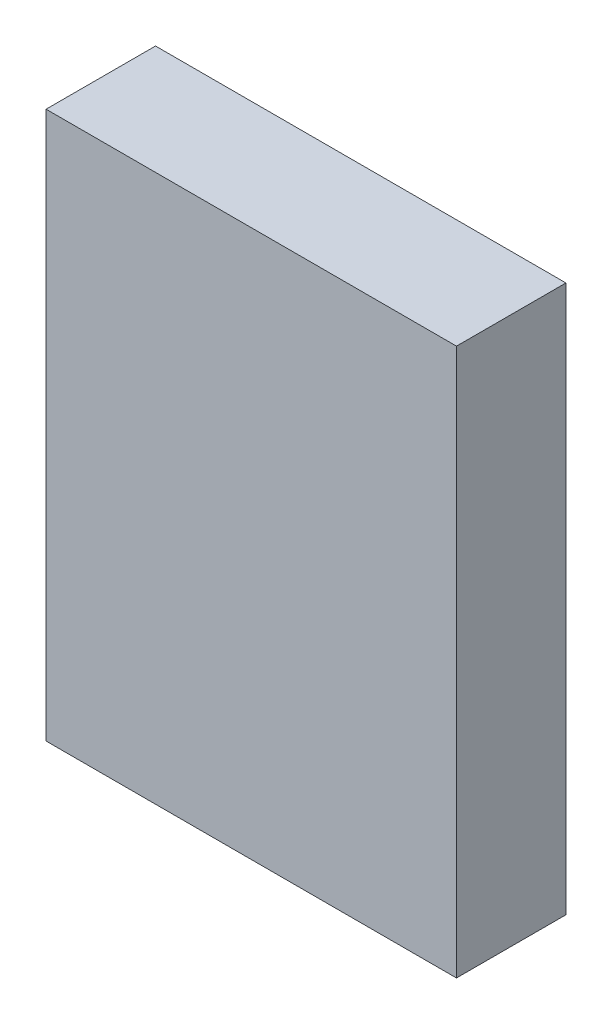
ISO-10303-21;
HEADER;
FILE_DESCRIPTION(('STEP AP214'),'2;1');
FILE_NAME('part.step','',(''),(''),'','','');
FILE_SCHEMA(('AUTOMOTIVE_DESIGN { 1 0 10303 214 1 1 1 1 }'));
ENDSEC;
DATA;
#1=APPLICATION_CONTEXT('core data for automotive mechanical design processes');
#2=APPLICATION_PROTOCOL_DEFINITION('international standard','automotive_design',2000,#1);
#3=PRODUCT_CONTEXT('',#1,'mechanical');
#4=PRODUCT('Part','Part','',(#3));
#5=PRODUCT_RELATED_PRODUCT_CATEGORY('part','',(#4));
#6=PRODUCT_DEFINITION_FORMATION('','',#4);
#7=PRODUCT_DEFINITION_CONTEXT('part definition',#1,'design');
#8=PRODUCT_DEFINITION('design','',#6,#7);
#9=PRODUCT_DEFINITION_SHAPE('','',#8);
#10=(LENGTH_UNIT() NAMED_UNIT(*) SI_UNIT(.MILLI.,.METRE.));
#11=(NAMED_UNIT(*) PLANE_ANGLE_UNIT() SI_UNIT($,.RADIAN.));
#12=(NAMED_UNIT(*) SI_UNIT($,.STERADIAN.) SOLID_ANGLE_UNIT());
#13=UNCERTAINTY_MEASURE_WITH_UNIT(LENGTH_MEASURE(1.E-05),#10,'distance_accuracy_value','');
#14=(GEOMETRIC_REPRESENTATION_CONTEXT(3) GLOBAL_UNCERTAINTY_ASSIGNED_CONTEXT((#13)) GLOBAL_UNIT_ASSIGNED_CONTEXT((#10,
#11,#12)) REPRESENTATION_CONTEXT('',''));
#15=CARTESIAN_POINT('',(0.,0.,0.));
#16=DIRECTION('',(0.,0.,1.));
#17=DIRECTION('',(1.,0.,0.));
#18=AXIS2_PLACEMENT_3D('',#15,#16,#17);
#19=CARTESIAN_POINT('',(15.,20.,8.));
#20=DIRECTION('',(-1.,0.,0.));
#21=DIRECTION('',(0.,0.,1.));
#22=AXIS2_PLACEMENT_3D('',#19,#20,#21);
#23=PLANE('',#22);
#24=DIRECTION('',(0.,1.,0.));
#25=VECTOR('',#24,1.);
#26=CARTESIAN_POINT('',(15.,20.,0.));
#27=LINE('',#26,#25);
#28=CARTESIAN_POINT('',(15.,-20.,0.));
#29=VERTEX_POINT('',#28);
#30=CARTESIAN_POINT('',(15.,20.,0.));
#31=VERTEX_POINT('',#30);
#32=EDGE_CURVE('E111',#29,#31,#27,.T.);
#33=ORIENTED_EDGE('',*,*,#32,.T.);
#34=DIRECTION('',(0.,0.,-1.));
#35=VECTOR('',#34,1.);
#36=CARTESIAN_POINT('',(15.,20.,8.));
#37=LINE('',#36,#35);
#38=CARTESIAN_POINT('',(15.,20.,8.));
#39=VERTEX_POINT('',#38);
#40=EDGE_CURVE('E11',#39,#31,#37,.T.);
#41=ORIENTED_EDGE('',*,*,#40,.F.);
#42=DIRECTION('',(0.,1.,0.));
#43=VECTOR('',#42,1.);
#44=CARTESIAN_POINT('',(15.,20.,8.));
#45=LINE('',#44,#43);
#46=CARTESIAN_POINT('',(15.,-20.,8.));
#47=VERTEX_POINT('',#46);
#48=EDGE_CURVE('E95',#47,#39,#45,.T.);
#49=ORIENTED_EDGE('',*,*,#48,.F.);
#50=DIRECTION('',(0.,0.,-1.));
#51=VECTOR('',#50,1.);
#52=CARTESIAN_POINT('',(15.,-20.,8.));
#53=LINE('',#52,#51);
#54=EDGE_CURVE('E107',#47,#29,#53,.T.);
#55=ORIENTED_EDGE('',*,*,#54,.T.);
#56=EDGE_LOOP('',(#33,#41,#49,#55));
#57=FACE_BOUND('',#56,.T.);
#58=ADVANCED_FACE('F43',(#57),#23,.F.);
#59=CARTESIAN_POINT('',(-15.,20.,8.));
#60=DIRECTION('',(0.,-1.,0.));
#61=DIRECTION('',(0.,0.,-1.));
#62=AXIS2_PLACEMENT_3D('',#59,#60,#61);
#63=PLANE('',#62);
#64=DIRECTION('',(-1.,0.,0.));
#65=VECTOR('',#64,1.);
#66=CARTESIAN_POINT('',(-15.,20.,0.));
#67=LINE('',#66,#65);
#68=CARTESIAN_POINT('',(-15.,20.,0.));
#69=VERTEX_POINT('',#68);
#70=EDGE_CURVE('E100',#31,#69,#67,.T.);
#71=ORIENTED_EDGE('',*,*,#70,.T.);
#72=DIRECTION('',(0.,0.,-1.));
#73=VECTOR('',#72,1.);
#74=CARTESIAN_POINT('',(-15.,20.,8.));
#75=LINE('',#74,#73);
#76=CARTESIAN_POINT('',(-15.,20.,8.));
#77=VERTEX_POINT('',#76);
#78=EDGE_CURVE('E52',#77,#69,#75,.T.);
#79=ORIENTED_EDGE('',*,*,#78,.F.);
#80=DIRECTION('',(-1.,0.,0.));
#81=VECTOR('',#80,1.);
#82=CARTESIAN_POINT('',(-15.,20.,8.));
#83=LINE('',#82,#81);
#84=EDGE_CURVE('E90',#39,#77,#83,.T.);
#85=ORIENTED_EDGE('',*,*,#84,.F.);
#86=ORIENTED_EDGE('',*,*,#40,.T.);
#87=EDGE_LOOP('',(#71,#79,#85,#86));
#88=FACE_BOUND('',#87,.T.);
#89=ADVANCED_FACE('F99',(#88),#63,.F.);
#90=CARTESIAN_POINT('',(-15.,20.,8.));
#91=DIRECTION('',(1.,0.,0.));
#92=DIRECTION('',(0.,1.,0.));
#93=AXIS2_PLACEMENT_3D('',#90,#91,#92);
#94=PLANE('',#93);
#95=DIRECTION('',(0.,-1.,0.));
#96=VECTOR('',#95,1.);
#97=CARTESIAN_POINT('',(-15.,20.,0.));
#98=LINE('',#97,#96);
#99=CARTESIAN_POINT('',(-15.,-20.,0.));
#100=VERTEX_POINT('',#99);
#101=EDGE_CURVE('E77',#69,#100,#98,.T.);
#102=ORIENTED_EDGE('',*,*,#101,.T.);
#103=DIRECTION('',(0.,0.,-1.));
#104=VECTOR('',#103,1.);
#105=CARTESIAN_POINT('',(-15.,-20.,8.));
#106=LINE('',#105,#104);
#107=CARTESIAN_POINT('',(-15.,-20.,8.));
#108=VERTEX_POINT('',#107);
#109=EDGE_CURVE('E102',#108,#100,#106,.T.);
#110=ORIENTED_EDGE('',*,*,#109,.F.);
#111=DIRECTION('',(0.,-1.,0.));
#112=VECTOR('',#111,1.);
#113=CARTESIAN_POINT('',(-15.,20.,8.));
#114=LINE('',#113,#112);
#115=EDGE_CURVE('E93',#77,#108,#114,.T.);
#116=ORIENTED_EDGE('',*,*,#115,.F.);
#117=ORIENTED_EDGE('',*,*,#78,.T.);
#118=EDGE_LOOP('',(#102,#110,#116,#117));
#119=FACE_BOUND('',#118,.T.);
#120=ADVANCED_FACE('F103',(#119),#94,.F.);
#121=CARTESIAN_POINT('',(-15.,-20.,8.));
#122=DIRECTION('',(0.,1.,0.));
#123=DIRECTION('',(0.,0.,1.));
#124=AXIS2_PLACEMENT_3D('',#121,#122,#123);
#125=PLANE('',#124);
#126=DIRECTION('',(1.,0.,0.));
#127=VECTOR('',#126,1.);
#128=CARTESIAN_POINT('',(-15.,-20.,0.));
#129=LINE('',#128,#127);
#130=EDGE_CURVE('E83',#100,#29,#129,.T.);
#131=ORIENTED_EDGE('',*,*,#130,.T.);
#132=ORIENTED_EDGE('',*,*,#54,.F.);
#133=DIRECTION('',(1.,0.,0.));
#134=VECTOR('',#133,1.);
#135=CARTESIAN_POINT('',(-15.,-20.,8.));
#136=LINE('',#135,#134);
#137=EDGE_CURVE('E60',#108,#47,#136,.T.);
#138=ORIENTED_EDGE('',*,*,#137,.F.);
#139=ORIENTED_EDGE('',*,*,#109,.T.);
#140=EDGE_LOOP('',(#131,#132,#138,#139));
#141=FACE_BOUND('',#140,.T.);
#142=ADVANCED_FACE('F124',(#141),#125,.F.);
#143=CARTESIAN_POINT('',(0.,0.,8.));
#144=DIRECTION('',(0.,0.,1.));
#145=DIRECTION('',(1.,0.,0.));
#146=AXIS2_PLACEMENT_3D('',#143,#144,#145);
#147=PLANE('',#146);
#148=ORIENTED_EDGE('',*,*,#48,.T.);
#149=ORIENTED_EDGE('',*,*,#84,.T.);
#150=ORIENTED_EDGE('',*,*,#115,.T.);
#151=ORIENTED_EDGE('',*,*,#137,.T.);
#152=EDGE_LOOP('',(#148,#149,#150,#151));
#153=FACE_BOUND('',#152,.T.);
#154=ADVANCED_FACE('F91',(#153),#147,.T.);
#155=CARTESIAN_POINT('',(0.,0.,0.));
#156=DIRECTION('',(0.,0.,1.));
#157=DIRECTION('',(1.,0.,0.));
#158=AXIS2_PLACEMENT_3D('',#155,#156,#157);
#159=PLANE('',#158);
#160=ORIENTED_EDGE('',*,*,#32,.F.);
#161=ORIENTED_EDGE('',*,*,#130,.F.);
#162=ORIENTED_EDGE('',*,*,#101,.F.);
#163=ORIENTED_EDGE('',*,*,#70,.F.);
#164=EDGE_LOOP('',(#160,#161,#162,#163));
#165=FACE_BOUND('',#164,.T.);
#166=ADVANCED_FACE('F127',(#165),#159,.F.);
#167=CLOSED_SHELL('',(#58,#89,#120,#142,#154,#166));
#168=MANIFOLD_SOLID_BREP('B2',#167);
#169=ADVANCED_BREP_SHAPE_REPRESENTATION('',(#18,#168),#14);
#170=SHAPE_DEFINITION_REPRESENTATION(#9,#169);
ENDSEC;
END-ISO-10303-21;
